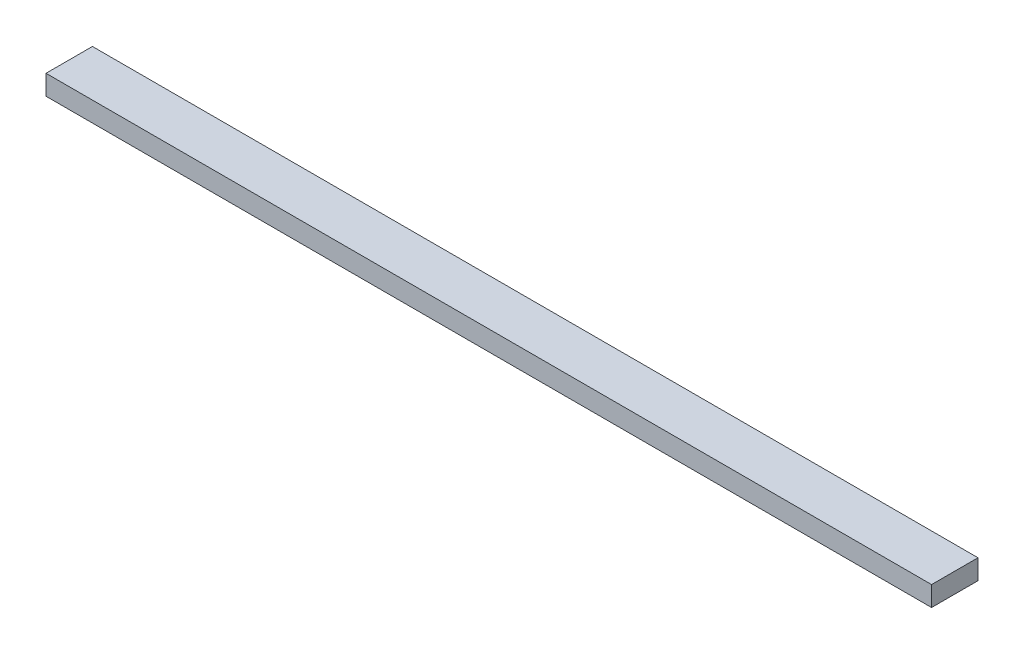
ISO-10303-21;
HEADER;
FILE_DESCRIPTION(('STEP AP214'),'2;1');
FILE_NAME('part.step','',(''),(''),'','','');
FILE_SCHEMA(('AUTOMOTIVE_DESIGN { 1 0 10303 214 1 1 1 1 }'));
ENDSEC;
DATA;
#1=APPLICATION_CONTEXT('core data for automotive mechanical design processes');
#2=APPLICATION_PROTOCOL_DEFINITION('international standard','automotive_design',2000,#1);
#3=PRODUCT_CONTEXT('',#1,'mechanical');
#4=PRODUCT('Part','Part','',(#3));
#5=PRODUCT_RELATED_PRODUCT_CATEGORY('part','',(#4));
#6=PRODUCT_DEFINITION_FORMATION('','',#4);
#7=PRODUCT_DEFINITION_CONTEXT('part definition',#1,'design');
#8=PRODUCT_DEFINITION('design','',#6,#7);
#9=PRODUCT_DEFINITION_SHAPE('','',#8);
#10=(LENGTH_UNIT() NAMED_UNIT(*) SI_UNIT(.MILLI.,.METRE.));
#11=(NAMED_UNIT(*) PLANE_ANGLE_UNIT() SI_UNIT($,.RADIAN.));
#12=(NAMED_UNIT(*) SI_UNIT($,.STERADIAN.) SOLID_ANGLE_UNIT());
#13=UNCERTAINTY_MEASURE_WITH_UNIT(LENGTH_MEASURE(1.E-05),#10,'distance_accuracy_value','');
#14=(GEOMETRIC_REPRESENTATION_CONTEXT(3) GLOBAL_UNCERTAINTY_ASSIGNED_CONTEXT((#13)) GLOBAL_UNIT_ASSIGNED_CONTEXT((#10,
#11,#12)) REPRESENTATION_CONTEXT('',''));
#15=CARTESIAN_POINT('',(0.,0.,0.));
#16=DIRECTION('',(0.,0.,1.));
#17=DIRECTION('',(1.,0.,0.));
#18=AXIS2_PLACEMENT_3D('',#15,#16,#17);
#19=CARTESIAN_POINT('',(0.,38.1,0.));
#20=DIRECTION('',(1.,0.,0.));
#21=DIRECTION('',(0.,0.,-1.));
#22=AXIS2_PLACEMENT_3D('',#19,#20,#21);
#23=PLANE('',#22);
#24=DIRECTION('',(0.,0.,1.));
#25=VECTOR('',#24,1.);
#26=CARTESIAN_POINT('',(0.,0.,0.));
#27=LINE('',#26,#25);
#28=CARTESIAN_POINT('',(0.,0.,-88.9));
#29=VERTEX_POINT('',#28);
#30=CARTESIAN_POINT('',(0.,0.,0.));
#31=VERTEX_POINT('',#30);
#32=EDGE_CURVE('E101',#29,#31,#27,.T.);
#33=ORIENTED_EDGE('',*,*,#32,.T.);
#34=DIRECTION('',(0.,-1.,0.));
#35=VECTOR('',#34,1.);
#36=CARTESIAN_POINT('',(0.,38.1,0.));
#37=LINE('',#36,#35);
#38=CARTESIAN_POINT('',(0.,38.1,0.));
#39=VERTEX_POINT('',#38);
#40=EDGE_CURVE('E11',#39,#31,#37,.T.);
#41=ORIENTED_EDGE('',*,*,#40,.F.);
#42=DIRECTION('',(0.,0.,1.));
#43=VECTOR('',#42,1.);
#44=CARTESIAN_POINT('',(0.,38.1,0.));
#45=LINE('',#44,#43);
#46=CARTESIAN_POINT('',(0.,38.1,-88.9));
#47=VERTEX_POINT('',#46);
#48=EDGE_CURVE('E89',#47,#39,#45,.T.);
#49=ORIENTED_EDGE('',*,*,#48,.F.);
#50=DIRECTION('',(0.,-1.,0.));
#51=VECTOR('',#50,1.);
#52=CARTESIAN_POINT('',(0.,38.1,-88.9));
#53=LINE('',#52,#51);
#54=EDGE_CURVE('E97',#47,#29,#53,.T.);
#55=ORIENTED_EDGE('',*,*,#54,.T.);
#56=EDGE_LOOP('',(#33,#41,#49,#55));
#57=FACE_BOUND('',#56,.T.);
#58=ADVANCED_FACE('F38',(#57),#23,.F.);
#59=CARTESIAN_POINT('',(0.,38.1,0.));
#60=DIRECTION('',(0.,0.,-1.));
#61=DIRECTION('',(-1.,0.,0.));
#62=AXIS2_PLACEMENT_3D('',#59,#60,#61);
#63=PLANE('',#62);
#64=DIRECTION('',(1.,0.,0.));
#65=VECTOR('',#64,1.);
#66=CARTESIAN_POINT('',(0.,0.,0.));
#67=LINE('',#66,#65);
#68=CARTESIAN_POINT('',(1695.45,0.,0.));
#69=VERTEX_POINT('',#68);
#70=EDGE_CURVE('E93',#31,#69,#67,.T.);
#71=ORIENTED_EDGE('',*,*,#70,.T.);
#72=DIRECTION('',(0.,-1.,0.));
#73=VECTOR('',#72,1.);
#74=CARTESIAN_POINT('',(1695.45,38.1,0.));
#75=LINE('',#74,#73);
#76=CARTESIAN_POINT('',(1695.45,38.1,0.));
#77=VERTEX_POINT('',#76);
#78=EDGE_CURVE('E46',#77,#69,#75,.T.);
#79=ORIENTED_EDGE('',*,*,#78,.F.);
#80=DIRECTION('',(1.,0.,0.));
#81=VECTOR('',#80,1.);
#82=CARTESIAN_POINT('',(0.,38.1,0.));
#83=LINE('',#82,#81);
#84=EDGE_CURVE('E84',#39,#77,#83,.T.);
#85=ORIENTED_EDGE('',*,*,#84,.F.);
#86=ORIENTED_EDGE('',*,*,#40,.T.);
#87=EDGE_LOOP('',(#71,#79,#85,#86));
#88=FACE_BOUND('',#87,.T.);
#89=ADVANCED_FACE('F92',(#88),#63,.F.);
#90=CARTESIAN_POINT('',(1695.45,38.1,0.));
#91=DIRECTION('',(-1.,0.,0.));
#92=DIRECTION('',(0.,0.,1.));
#93=AXIS2_PLACEMENT_3D('',#90,#91,#92);
#94=PLANE('',#93);
#95=DIRECTION('',(0.,0.,-1.));
#96=VECTOR('',#95,1.);
#97=CARTESIAN_POINT('',(1695.45,0.,0.));
#98=LINE('',#97,#96);
#99=CARTESIAN_POINT('',(1695.45,0.,-88.9));
#100=VERTEX_POINT('',#99);
#101=EDGE_CURVE('E71',#69,#100,#98,.T.);
#102=ORIENTED_EDGE('',*,*,#101,.T.);
#103=DIRECTION('',(0.,-1.,0.));
#104=VECTOR('',#103,1.);
#105=CARTESIAN_POINT('',(1695.45,38.1,-88.9));
#106=LINE('',#105,#104);
#107=CARTESIAN_POINT('',(1695.45,38.1,-88.9));
#108=VERTEX_POINT('',#107);
#109=EDGE_CURVE('E94',#108,#100,#106,.T.);
#110=ORIENTED_EDGE('',*,*,#109,.F.);
#111=DIRECTION('',(0.,0.,-1.));
#112=VECTOR('',#111,1.);
#113=CARTESIAN_POINT('',(1695.45,38.1,0.));
#114=LINE('',#113,#112);
#115=EDGE_CURVE('E87',#77,#108,#114,.T.);
#116=ORIENTED_EDGE('',*,*,#115,.F.);
#117=ORIENTED_EDGE('',*,*,#78,.T.);
#118=EDGE_LOOP('',(#102,#110,#116,#117));
#119=FACE_BOUND('',#118,.T.);
#120=ADVANCED_FACE('F95',(#119),#94,.F.);
#121=CARTESIAN_POINT('',(0.,38.1,-88.9));
#122=DIRECTION('',(0.,0.,1.));
#123=DIRECTION('',(1.,0.,0.));
#124=AXIS2_PLACEMENT_3D('',#121,#122,#123);
#125=PLANE('',#124);
#126=DIRECTION('',(-1.,0.,0.));
#127=VECTOR('',#126,1.);
#128=CARTESIAN_POINT('',(0.,0.,-88.9));
#129=LINE('',#128,#127);
#130=EDGE_CURVE('E77',#100,#29,#129,.T.);
#131=ORIENTED_EDGE('',*,*,#130,.T.);
#132=ORIENTED_EDGE('',*,*,#54,.F.);
#133=DIRECTION('',(-1.,0.,0.));
#134=VECTOR('',#133,1.);
#135=CARTESIAN_POINT('',(0.,38.1,-88.9));
#136=LINE('',#135,#134);
#137=EDGE_CURVE('E54',#108,#47,#136,.T.);
#138=ORIENTED_EDGE('',*,*,#137,.F.);
#139=ORIENTED_EDGE('',*,*,#109,.T.);
#140=EDGE_LOOP('',(#131,#132,#138,#139));
#141=FACE_BOUND('',#140,.T.);
#142=ADVANCED_FACE('F108',(#141),#125,.F.);
#143=CARTESIAN_POINT('',(0.,38.1,0.));
#144=DIRECTION('',(0.,-1.,0.));
#145=DIRECTION('',(0.,0.,-1.));
#146=AXIS2_PLACEMENT_3D('',#143,#144,#145);
#147=PLANE('',#146);
#148=ORIENTED_EDGE('',*,*,#48,.T.);
#149=ORIENTED_EDGE('',*,*,#84,.T.);
#150=ORIENTED_EDGE('',*,*,#115,.T.);
#151=ORIENTED_EDGE('',*,*,#137,.T.);
#152=EDGE_LOOP('',(#148,#149,#150,#151));
#153=FACE_BOUND('',#152,.T.);
#154=ADVANCED_FACE('F85',(#153),#147,.F.);
#155=CARTESIAN_POINT('',(0.,0.,0.));
#156=DIRECTION('',(0.,-1.,0.));
#157=DIRECTION('',(0.,0.,-1.));
#158=AXIS2_PLACEMENT_3D('',#155,#156,#157);
#159=PLANE('',#158);
#160=ORIENTED_EDGE('',*,*,#32,.F.);
#161=ORIENTED_EDGE('',*,*,#130,.F.);
#162=ORIENTED_EDGE('',*,*,#101,.F.);
#163=ORIENTED_EDGE('',*,*,#70,.F.);
#164=EDGE_LOOP('',(#160,#161,#162,#163));
#165=FACE_BOUND('',#164,.T.);
#166=ADVANCED_FACE('F111',(#165),#159,.T.);
#167=CLOSED_SHELL('',(#58,#89,#120,#142,#154,#166));
#168=MANIFOLD_SOLID_BREP('B2',#167);
#169=ADVANCED_BREP_SHAPE_REPRESENTATION('',(#18,#168),#14);
#170=SHAPE_DEFINITION_REPRESENTATION(#9,#169);
ENDSEC;
END-ISO-10303-21;
